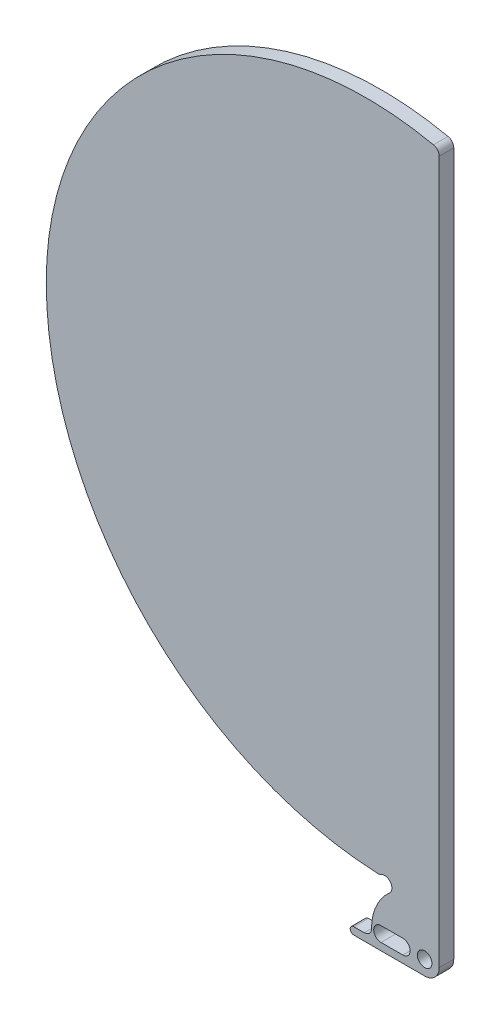
ISO-10303-21;
HEADER;
FILE_DESCRIPTION(('STEP AP214'),'2;1');
FILE_NAME('part.step','',(''),(''),'','','');
FILE_SCHEMA(('AUTOMOTIVE_DESIGN { 1 0 10303 214 1 1 1 1 }'));
ENDSEC;
DATA;
#1=APPLICATION_CONTEXT('core data for automotive mechanical design processes');
#2=APPLICATION_PROTOCOL_DEFINITION('international standard','automotive_design',2000,#1);
#3=PRODUCT_CONTEXT('',#1,'mechanical');
#4=PRODUCT('Part','Part','',(#3));
#5=PRODUCT_RELATED_PRODUCT_CATEGORY('part','',(#4));
#6=PRODUCT_DEFINITION_FORMATION('','',#4);
#7=PRODUCT_DEFINITION_CONTEXT('part definition',#1,'design');
#8=PRODUCT_DEFINITION('design','',#6,#7);
#9=PRODUCT_DEFINITION_SHAPE('','',#8);
#10=(LENGTH_UNIT() NAMED_UNIT(*) SI_UNIT(.MILLI.,.METRE.));
#11=(NAMED_UNIT(*) PLANE_ANGLE_UNIT() SI_UNIT($,.RADIAN.));
#12=(NAMED_UNIT(*) SI_UNIT($,.STERADIAN.) SOLID_ANGLE_UNIT());
#13=UNCERTAINTY_MEASURE_WITH_UNIT(LENGTH_MEASURE(1.E-05),#10,'distance_accuracy_value','');
#14=(GEOMETRIC_REPRESENTATION_CONTEXT(3) GLOBAL_UNCERTAINTY_ASSIGNED_CONTEXT((#13)) GLOBAL_UNIT_ASSIGNED_CONTEXT((#10,
#11,#12)) REPRESENTATION_CONTEXT('',''));
#15=CARTESIAN_POINT('',(0.,0.,0.));
#16=DIRECTION('',(0.,0.,1.));
#17=DIRECTION('',(1.,0.,0.));
#18=AXIS2_PLACEMENT_3D('',#15,#16,#17);
#19=CARTESIAN_POINT('',(-5.,25.75,0.5));
#20=DIRECTION('',(0.,0.,-1.));
#21=DIRECTION('',(-1.,0.,0.));
#22=AXIS2_PLACEMENT_3D('',#19,#20,#21);
#23=PLANE('',#22);
#24=CARTESIAN_POINT('',(-1.,-1.5,0.5));
#25=DIRECTION('',(0.,0.,1.));
#26=DIRECTION('',(1.,0.,0.));
#27=AXIS2_PLACEMENT_3D('',#24,#25,#26);
#28=CIRCLE('',#27,0.499999999999999);
#29=CARTESIAN_POINT('',(-0.500000000000001,-1.5,0.5));
#30=VERTEX_POINT('',#29);
#31=EDGE_CURVE('E199',#30,#30,#28,.T.);
#32=ORIENTED_EDGE('',*,*,#31,.F.);
#33=EDGE_LOOP('',(#32));
#34=FACE_BOUND('',#33,.T.);
#35=DIRECTION('',(-1.,0.,0.));
#36=VECTOR('',#35,1.);
#37=CARTESIAN_POINT('',(-4.61559123795819,-2.,0.5));
#38=LINE('',#37,#36);
#39=CARTESIAN_POINT('',(-5.15,-2.,0.5));
#40=VERTEX_POINT('',#39);
#41=CARTESIAN_POINT('',(-5.86559123795818,-2.,0.5));
#42=VERTEX_POINT('',#41);
#43=EDGE_CURVE('E216',#40,#42,#38,.T.);
#44=ORIENTED_EDGE('',*,*,#43,.T.);
#45=CARTESIAN_POINT('',(-5.86559123795818,-2.25,0.5));
#46=DIRECTION('',(0.,0.,-1.));
#47=DIRECTION('',(-1.,0.,0.));
#48=AXIS2_PLACEMENT_3D('',#45,#46,#47);
#49=CIRCLE('',#48,0.25);
#50=CARTESIAN_POINT('',(-6.11559123795818,-2.25,0.5));
#51=VERTEX_POINT('',#50);
#52=EDGE_CURVE('E273',#42,#51,#49,.F.);
#53=ORIENTED_EDGE('',*,*,#52,.T.);
#54=CARTESIAN_POINT('',(-5.86559123795819,-2.25,0.5));
#55=DIRECTION('',(0.,0.,-1.));
#56=DIRECTION('',(-1.,0.,0.));
#57=AXIS2_PLACEMENT_3D('',#54,#55,#56);
#58=CIRCLE('',#57,0.25);
#59=CARTESIAN_POINT('',(-5.86559123795819,-2.5,0.5));
#60=VERTEX_POINT('',#59);
#61=EDGE_CURVE('E60',#51,#60,#58,.F.);
#62=ORIENTED_EDGE('',*,*,#61,.T.);
#63=DIRECTION('',(1.,0.,0.));
#64=VECTOR('',#63,1.);
#65=CARTESIAN_POINT('',(-6.11559123795819,-2.5,0.5));
#66=LINE('',#65,#64);
#67=CARTESIAN_POINT('',(-1.,-2.5,0.5));
#68=VERTEX_POINT('',#67);
#69=EDGE_CURVE('E219',#60,#68,#66,.T.);
#70=ORIENTED_EDGE('',*,*,#69,.T.);
#71=CARTESIAN_POINT('',(-1.,-1.5,0.5));
#72=DIRECTION('',(0.,0.,1.));
#73=DIRECTION('',(1.,0.,0.));
#74=AXIS2_PLACEMENT_3D('',#71,#72,#73);
#75=CIRCLE('',#74,1.);
#76=CARTESIAN_POINT('',(0.,-1.5,0.5));
#77=VERTEX_POINT('',#76);
#78=EDGE_CURVE('E221',#68,#77,#75,.T.);
#79=ORIENTED_EDGE('',*,*,#78,.T.);
#80=DIRECTION('',(0.,1.,0.));
#81=VECTOR('',#80,1.);
#82=CARTESIAN_POINT('',(0.,-1.5,0.5));
#83=LINE('',#82,#81);
#84=CARTESIAN_POINT('',(0.,46.7737925723295,0.5));
#85=VERTEX_POINT('',#84);
#86=EDGE_CURVE('E223',#77,#85,#83,.T.);
#87=ORIENTED_EDGE('',*,*,#86,.T.);
#88=CARTESIAN_POINT('',(-0.5,46.7737925723295,0.5));
#89=DIRECTION('',(0.,0.,-1.));
#90=DIRECTION('',(-1.,0.,0.));
#91=AXIS2_PLACEMENT_3D('',#88,#89,#90);
#92=CIRCLE('',#91,0.5);
#93=CARTESIAN_POINT('',(-0.395348820696528,47.2627180581353,0.5));
#94=VERTEX_POINT('',#93);
#95=EDGE_CURVE('E270',#85,#94,#92,.F.);
#96=ORIENTED_EDGE('',*,*,#95,.T.);
#97=CARTESIAN_POINT('',(-5.,25.75,0.5));
#98=DIRECTION('',(0.,0.,1.));
#99=DIRECTION('',(-1.,0.,0.));
#100=AXIS2_PLACEMENT_3D('',#97,#98,#99);
#101=CIRCLE('',#100,21.9999966075425);
#102=CARTESIAN_POINT('',(-26.9999966075425,25.75,0.5));
#103=VERTEX_POINT('',#102);
#104=EDGE_CURVE('E205',#94,#103,#101,.T.);
#105=ORIENTED_EDGE('',*,*,#104,.T.);
#106=CARTESIAN_POINT('',(-3.15014615702515,25.8142703807271,0.5));
#107=DIRECTION('',(0.,0.,1.));
#108=DIRECTION('',(-1.,0.,0.));
#109=AXIS2_PLACEMENT_3D('',#106,#107,#108);
#110=CIRCLE('',#109,23.8499370480067);
#111=CARTESIAN_POINT('',(-4.24618895728837,1.98953140264235,0.5));
#112=VERTEX_POINT('',#111);
#113=EDGE_CURVE('E207',#103,#112,#110,.T.);
#114=ORIENTED_EDGE('',*,*,#113,.T.);
#115=CARTESIAN_POINT('',(-4.22321106015479,2.48900313982406,0.5));
#116=DIRECTION('',(0.,0.,-1.));
#117=DIRECTION('',(-1.,0.,0.));
#118=AXIS2_PLACEMENT_3D('',#115,#116,#117);
#119=CIRCLE('',#118,0.5);
#120=CARTESIAN_POINT('',(-3.98660553007739,2.04852859670404,0.5));
#121=VERTEX_POINT('',#120);
#122=EDGE_CURVE('E268',#112,#121,#119,.F.);
#123=ORIENTED_EDGE('',*,*,#122,.T.);
#124=CARTESIAN_POINT('',(-3.75,1.60805405358401,0.5));
#125=DIRECTION('',(0.,0.,-1.));
#126=DIRECTION('',(1.,0.,0.));
#127=AXIS2_PLACEMENT_3D('',#124,#125,#126);
#128=CIRCLE('',#127,0.499999999999999);
#129=CARTESIAN_POINT('',(-3.41867469879518,1.23358970977871,0.5));
#130=VERTEX_POINT('',#129);
#131=EDGE_CURVE('E211',#121,#130,#128,.T.);
#132=ORIENTED_EDGE('',*,*,#131,.T.);
#133=CARTESIAN_POINT('',(-1.,-1.5,0.5));
#134=DIRECTION('',(0.,0.,1.));
#135=DIRECTION('',(1.,0.,0.));
#136=AXIS2_PLACEMENT_3D('',#133,#134,#135);
#137=CIRCLE('',#136,3.65);
#138=CARTESIAN_POINT('',(-4.65,-1.5,0.5));
#139=VERTEX_POINT('',#138);
#140=EDGE_CURVE('E213',#130,#139,#137,.T.);
#141=ORIENTED_EDGE('',*,*,#140,.T.);
#142=CARTESIAN_POINT('',(-5.15,-1.5,0.5));
#143=DIRECTION('',(0.,0.,-1.));
#144=DIRECTION('',(-1.,0.,0.));
#145=AXIS2_PLACEMENT_3D('',#142,#143,#144);
#146=CIRCLE('',#145,0.5);
#147=EDGE_CURVE('E12',#139,#40,#146,.T.);
#148=ORIENTED_EDGE('',*,*,#147,.T.);
#149=EDGE_LOOP('',(#44,#53,#62,#70,#79,#87,#96,#105,#114,#123,#132,#141,#148));
#150=FACE_BOUND('',#149,.T.);
#151=CARTESIAN_POINT('',(-4.,-1.5,0.5));
#152=DIRECTION('',(0.,0.,1.));
#153=DIRECTION('',(1.,0.,0.));
#154=AXIS2_PLACEMENT_3D('',#151,#152,#153);
#155=CIRCLE('',#154,0.499999999999999);
#156=CARTESIAN_POINT('',(-4.,-1.,0.5));
#157=VERTEX_POINT('',#156);
#158=CARTESIAN_POINT('',(-4.,-2.,0.5));
#159=VERTEX_POINT('',#158);
#160=EDGE_CURVE('E158',#157,#159,#155,.T.);
#161=ORIENTED_EDGE('',*,*,#160,.F.);
#162=DIRECTION('',(-1.,0.,0.));
#163=VECTOR('',#162,1.);
#164=CARTESIAN_POINT('',(-4.,-1.,0.5));
#165=LINE('',#164,#163);
#166=CARTESIAN_POINT('',(-2.5,-0.999999999999999,0.5));
#167=VERTEX_POINT('',#166);
#168=EDGE_CURVE('E183',#167,#157,#165,.T.);
#169=ORIENTED_EDGE('',*,*,#168,.F.);
#170=CARTESIAN_POINT('',(-2.5,-1.5,0.5));
#171=DIRECTION('',(0.,0.,1.));
#172=DIRECTION('',(1.,0.,0.));
#173=AXIS2_PLACEMENT_3D('',#170,#171,#172);
#174=CIRCLE('',#173,0.5);
#175=CARTESIAN_POINT('',(-2.5,-2.,0.5));
#176=VERTEX_POINT('',#175);
#177=EDGE_CURVE('E181',#176,#167,#174,.T.);
#178=ORIENTED_EDGE('',*,*,#177,.F.);
#179=DIRECTION('',(1.,0.,0.));
#180=VECTOR('',#179,1.);
#181=CARTESIAN_POINT('',(-4.,-2.,0.5));
#182=LINE('',#181,#180);
#183=EDGE_CURVE('E168',#159,#176,#182,.T.);
#184=ORIENTED_EDGE('',*,*,#183,.F.);
#185=EDGE_LOOP('',(#161,#169,#178,#184));
#186=FACE_BOUND('',#185,.T.);
#187=ADVANCED_FACE('F36',(#34,#150,#186),#23,.F.);
#188=CARTESIAN_POINT('',(-5.,25.75,-0.5));
#189=DIRECTION('',(0.,0.,-1.));
#190=DIRECTION('',(-1.,0.,0.));
#191=AXIS2_PLACEMENT_3D('',#188,#189,#190);
#192=PLANE('',#191);
#193=CARTESIAN_POINT('',(-1.,-1.5,-0.5));
#194=DIRECTION('',(0.,0.,1.));
#195=DIRECTION('',(1.,0.,0.));
#196=AXIS2_PLACEMENT_3D('',#193,#194,#195);
#197=CIRCLE('',#196,0.499999999999999);
#198=CARTESIAN_POINT('',(-0.500000000000001,-1.5,-0.5));
#199=VERTEX_POINT('',#198);
#200=EDGE_CURVE('E176',#199,#199,#197,.T.);
#201=ORIENTED_EDGE('',*,*,#200,.T.);
#202=EDGE_LOOP('',(#201));
#203=FACE_BOUND('',#202,.T.);
#204=CARTESIAN_POINT('',(-5.86559123795819,-2.25,-0.5));
#205=DIRECTION('',(0.,0.,-1.));
#206=DIRECTION('',(-1.,0.,0.));
#207=AXIS2_PLACEMENT_3D('',#204,#205,#206);
#208=CIRCLE('',#207,0.25);
#209=CARTESIAN_POINT('',(-5.86559123795819,-2.5,-0.5));
#210=VERTEX_POINT('',#209);
#211=CARTESIAN_POINT('',(-6.11559123795818,-2.25,-0.5));
#212=VERTEX_POINT('',#211);
#213=EDGE_CURVE('E258',#210,#212,#208,.T.);
#214=ORIENTED_EDGE('',*,*,#213,.T.);
#215=CARTESIAN_POINT('',(-5.86559123795818,-2.25,-0.5));
#216=DIRECTION('',(0.,0.,-1.));
#217=DIRECTION('',(-1.,0.,0.));
#218=AXIS2_PLACEMENT_3D('',#215,#216,#217);
#219=CIRCLE('',#218,0.25);
#220=CARTESIAN_POINT('',(-5.86559123795818,-2.,-0.5));
#221=VERTEX_POINT('',#220);
#222=EDGE_CURVE('E260',#212,#221,#219,.T.);
#223=ORIENTED_EDGE('',*,*,#222,.T.);
#224=DIRECTION('',(-1.,0.,0.));
#225=VECTOR('',#224,1.);
#226=CARTESIAN_POINT('',(-4.61559123795819,-2.,-0.5));
#227=LINE('',#226,#225);
#228=CARTESIAN_POINT('',(-5.15,-2.,-0.5));
#229=VERTEX_POINT('',#228);
#230=EDGE_CURVE('E235',#229,#221,#227,.T.);
#231=ORIENTED_EDGE('',*,*,#230,.F.);
#232=CARTESIAN_POINT('',(-5.15,-1.5,-0.5));
#233=DIRECTION('',(0.,0.,-1.));
#234=DIRECTION('',(-1.,0.,0.));
#235=AXIS2_PLACEMENT_3D('',#232,#233,#234);
#236=CIRCLE('',#235,0.5);
#237=CARTESIAN_POINT('',(-4.65,-1.5,-0.5));
#238=VERTEX_POINT('',#237);
#239=EDGE_CURVE('E45',#229,#238,#236,.F.);
#240=ORIENTED_EDGE('',*,*,#239,.T.);
#241=CARTESIAN_POINT('',(-1.,-1.5,-0.5));
#242=DIRECTION('',(0.,0.,1.));
#243=DIRECTION('',(1.,0.,0.));
#244=AXIS2_PLACEMENT_3D('',#241,#242,#243);
#245=CIRCLE('',#244,3.65);
#246=CARTESIAN_POINT('',(-3.41867469879518,1.23358970977871,-0.5));
#247=VERTEX_POINT('',#246);
#248=EDGE_CURVE('E232',#247,#238,#245,.T.);
#249=ORIENTED_EDGE('',*,*,#248,.F.);
#250=CARTESIAN_POINT('',(-3.75,1.60805405358401,-0.5));
#251=DIRECTION('',(0.,0.,-1.));
#252=DIRECTION('',(1.,0.,0.));
#253=AXIS2_PLACEMENT_3D('',#250,#251,#252);
#254=CIRCLE('',#253,0.499999999999999);
#255=CARTESIAN_POINT('',(-3.98660553007739,2.04852859670404,-0.5));
#256=VERTEX_POINT('',#255);
#257=EDGE_CURVE('E230',#256,#247,#254,.T.);
#258=ORIENTED_EDGE('',*,*,#257,.F.);
#259=CARTESIAN_POINT('',(-4.22321106015479,2.48900313982406,-0.5));
#260=DIRECTION('',(0.,0.,-1.));
#261=DIRECTION('',(-1.,0.,0.));
#262=AXIS2_PLACEMENT_3D('',#259,#260,#261);
#263=CIRCLE('',#262,0.5);
#264=CARTESIAN_POINT('',(-4.24618895728837,1.98953140264235,-0.5));
#265=VERTEX_POINT('',#264);
#266=EDGE_CURVE('E254',#256,#265,#263,.T.);
#267=ORIENTED_EDGE('',*,*,#266,.T.);
#268=CARTESIAN_POINT('',(-3.15014615702515,25.8142703807271,-0.5));
#269=DIRECTION('',(0.,0.,1.));
#270=DIRECTION('',(-1.,0.,0.));
#271=AXIS2_PLACEMENT_3D('',#268,#269,#270);
#272=CIRCLE('',#271,23.8499370480067);
#273=CARTESIAN_POINT('',(-26.9999966075425,25.75,-0.5));
#274=VERTEX_POINT('',#273);
#275=EDGE_CURVE('E227',#274,#265,#272,.T.);
#276=ORIENTED_EDGE('',*,*,#275,.F.);
#277=CARTESIAN_POINT('',(-5.,25.75,-0.5));
#278=DIRECTION('',(0.,0.,1.));
#279=DIRECTION('',(-1.,0.,0.));
#280=AXIS2_PLACEMENT_3D('',#277,#278,#279);
#281=CIRCLE('',#280,21.9999966075425);
#282=CARTESIAN_POINT('',(-0.395348820696528,47.2627180581353,-0.5));
#283=VERTEX_POINT('',#282);
#284=EDGE_CURVE('E202',#283,#274,#281,.T.);
#285=ORIENTED_EDGE('',*,*,#284,.F.);
#286=CARTESIAN_POINT('',(-0.5,46.7737925723295,-0.5));
#287=DIRECTION('',(0.,0.,-1.));
#288=DIRECTION('',(-1.,0.,0.));
#289=AXIS2_PLACEMENT_3D('',#286,#287,#288);
#290=CIRCLE('',#289,0.5);
#291=CARTESIAN_POINT('',(0.,46.7737925723295,-0.5));
#292=VERTEX_POINT('',#291);
#293=EDGE_CURVE('E256',#283,#292,#290,.T.);
#294=ORIENTED_EDGE('',*,*,#293,.T.);
#295=DIRECTION('',(0.,1.,0.));
#296=VECTOR('',#295,1.);
#297=CARTESIAN_POINT('',(0.,-1.5,-0.5));
#298=LINE('',#297,#296);
#299=CARTESIAN_POINT('',(0.,-1.5,-0.5));
#300=VERTEX_POINT('',#299);
#301=EDGE_CURVE('E208',#300,#292,#298,.T.);
#302=ORIENTED_EDGE('',*,*,#301,.F.);
#303=CARTESIAN_POINT('',(-1.,-1.5,-0.5));
#304=DIRECTION('',(0.,0.,1.));
#305=DIRECTION('',(1.,0.,0.));
#306=AXIS2_PLACEMENT_3D('',#303,#304,#305);
#307=CIRCLE('',#306,1.);
#308=CARTESIAN_POINT('',(-1.,-2.5,-0.5));
#309=VERTEX_POINT('',#308);
#310=EDGE_CURVE('E240',#309,#300,#307,.T.);
#311=ORIENTED_EDGE('',*,*,#310,.F.);
#312=DIRECTION('',(1.,0.,0.));
#313=VECTOR('',#312,1.);
#314=CARTESIAN_POINT('',(-6.11559123795819,-2.5,-0.5));
#315=LINE('',#314,#313);
#316=EDGE_CURVE('E238',#210,#309,#315,.T.);
#317=ORIENTED_EDGE('',*,*,#316,.F.);
#318=EDGE_LOOP('',(#214,#223,#231,#240,#249,#258,#267,#276,#285,#294,#302,#311,#317));
#319=FACE_BOUND('',#318,.T.);
#320=DIRECTION('',(-1.,0.,0.));
#321=VECTOR('',#320,1.);
#322=CARTESIAN_POINT('',(-4.,-1.,-0.5));
#323=LINE('',#322,#321);
#324=CARTESIAN_POINT('',(-2.5,-0.999999999999999,-0.5));
#325=VERTEX_POINT('',#324);
#326=CARTESIAN_POINT('',(-4.,-1.,-0.5));
#327=VERTEX_POINT('',#326);
#328=EDGE_CURVE('E169',#325,#327,#323,.T.);
#329=ORIENTED_EDGE('',*,*,#328,.T.);
#330=CARTESIAN_POINT('',(-4.,-1.5,-0.5));
#331=DIRECTION('',(0.,0.,1.));
#332=DIRECTION('',(1.,0.,0.));
#333=AXIS2_PLACEMENT_3D('',#330,#331,#332);
#334=CIRCLE('',#333,0.499999999999999);
#335=CARTESIAN_POINT('',(-4.,-2.,-0.5));
#336=VERTEX_POINT('',#335);
#337=EDGE_CURVE('E187',#327,#336,#334,.T.);
#338=ORIENTED_EDGE('',*,*,#337,.T.);
#339=DIRECTION('',(1.,0.,0.));
#340=VECTOR('',#339,1.);
#341=CARTESIAN_POINT('',(-4.,-2.,-0.5));
#342=LINE('',#341,#340);
#343=CARTESIAN_POINT('',(-2.5,-2.,-0.5));
#344=VERTEX_POINT('',#343);
#345=EDGE_CURVE('E175',#336,#344,#342,.T.);
#346=ORIENTED_EDGE('',*,*,#345,.T.);
#347=CARTESIAN_POINT('',(-2.5,-1.5,-0.5));
#348=DIRECTION('',(0.,0.,1.));
#349=DIRECTION('',(1.,0.,0.));
#350=AXIS2_PLACEMENT_3D('',#347,#348,#349);
#351=CIRCLE('',#350,0.5);
#352=EDGE_CURVE('E190',#344,#325,#351,.T.);
#353=ORIENTED_EDGE('',*,*,#352,.T.);
#354=EDGE_LOOP('',(#329,#338,#346,#353));
#355=FACE_BOUND('',#354,.T.);
#356=ADVANCED_FACE('F291',(#203,#319,#355),#192,.T.);
#357=CARTESIAN_POINT('',(-5.,25.75,0.5));
#358=DIRECTION('',(0.,0.,-1.));
#359=DIRECTION('',(-1.,0.,0.));
#360=AXIS2_PLACEMENT_3D('',#357,#358,#359);
#361=CYLINDRICAL_SURFACE('',#360,21.9999966075425);
#362=ORIENTED_EDGE('',*,*,#104,.F.);
#363=DIRECTION('',(0.,0.,-1.));
#364=VECTOR('',#363,1.);
#365=CARTESIAN_POINT('',(-0.395348820696527,47.2627180581353,0.5));
#366=LINE('',#365,#364);
#367=EDGE_CURVE('E277',#94,#283,#366,.T.);
#368=ORIENTED_EDGE('',*,*,#367,.T.);
#369=ORIENTED_EDGE('',*,*,#284,.T.);
#370=DIRECTION('',(0.,0.,-1.));
#371=VECTOR('',#370,1.);
#372=CARTESIAN_POINT('',(-26.9999966075425,25.75,0.5));
#373=LINE('',#372,#371);
#374=EDGE_CURVE('E251',#103,#274,#373,.T.);
#375=ORIENTED_EDGE('',*,*,#374,.F.);
#376=EDGE_LOOP('',(#362,#368,#369,#375));
#377=FACE_BOUND('',#376,.T.);
#378=ADVANCED_FACE('F334',(#377),#361,.T.);
#379=CARTESIAN_POINT('',(-3.15014615702515,25.8142703807271,0.5));
#380=DIRECTION('',(0.,0.,-1.));
#381=DIRECTION('',(-1.,0.,0.));
#382=AXIS2_PLACEMENT_3D('',#379,#380,#381);
#383=CYLINDRICAL_SURFACE('',#382,23.8499370480067);
#384=ORIENTED_EDGE('',*,*,#275,.T.);
#385=DIRECTION('',(0.,0.,-1.));
#386=VECTOR('',#385,1.);
#387=CARTESIAN_POINT('',(-4.24618895728837,1.98953140264235,0.5));
#388=LINE('',#387,#386);
#389=EDGE_CURVE('E286',#265,#112,#388,.F.);
#390=ORIENTED_EDGE('',*,*,#389,.T.);
#391=ORIENTED_EDGE('',*,*,#113,.F.);
#392=ORIENTED_EDGE('',*,*,#374,.T.);
#393=EDGE_LOOP('',(#384,#390,#391,#392));
#394=FACE_BOUND('',#393,.T.);
#395=ADVANCED_FACE('F340',(#394),#383,.T.);
#396=CARTESIAN_POINT('',(-3.75,1.60805405358401,0.5));
#397=DIRECTION('',(0.,0.,-1.));
#398=DIRECTION('',(-1.,0.,0.));
#399=AXIS2_PLACEMENT_3D('',#396,#397,#398);
#400=CYLINDRICAL_SURFACE('',#399,0.499999999999999);
#401=ORIENTED_EDGE('',*,*,#131,.F.);
#402=DIRECTION('',(0.,0.,-1.));
#403=VECTOR('',#402,1.);
#404=CARTESIAN_POINT('',(-3.98660553007739,2.04852859670404,0.5));
#405=LINE('',#404,#403);
#406=EDGE_CURVE('E283',#121,#256,#405,.T.);
#407=ORIENTED_EDGE('',*,*,#406,.T.);
#408=ORIENTED_EDGE('',*,*,#257,.T.);
#409=DIRECTION('',(0.,0.,-1.));
#410=VECTOR('',#409,1.);
#411=CARTESIAN_POINT('',(-3.41867469879518,1.23358970977871,0.5));
#412=LINE('',#411,#410);
#413=EDGE_CURVE('E248',#130,#247,#412,.T.);
#414=ORIENTED_EDGE('',*,*,#413,.F.);
#415=EDGE_LOOP('',(#401,#407,#408,#414));
#416=FACE_BOUND('',#415,.T.);
#417=ADVANCED_FACE('F346',(#416),#400,.F.);
#418=CARTESIAN_POINT('',(-1.,-1.5,0.5));
#419=DIRECTION('',(0.,0.,-1.));
#420=DIRECTION('',(-1.,0.,0.));
#421=AXIS2_PLACEMENT_3D('',#418,#419,#420);
#422=CYLINDRICAL_SURFACE('',#421,3.65);
#423=ORIENTED_EDGE('',*,*,#248,.T.);
#424=DIRECTION('',(0.,0.,-1.));
#425=VECTOR('',#424,1.);
#426=CARTESIAN_POINT('',(-4.65,-1.5,0.5));
#427=LINE('',#426,#425);
#428=EDGE_CURVE('E281',#238,#139,#427,.F.);
#429=ORIENTED_EDGE('',*,*,#428,.T.);
#430=ORIENTED_EDGE('',*,*,#140,.F.);
#431=ORIENTED_EDGE('',*,*,#413,.T.);
#432=EDGE_LOOP('',(#423,#429,#430,#431));
#433=FACE_BOUND('',#432,.T.);
#434=ADVANCED_FACE('F298',(#433),#422,.T.);
#435=CARTESIAN_POINT('',(-4.61559123795819,-2.,0.5));
#436=DIRECTION('',(0.,-1.,0.));
#437=DIRECTION('',(1.,0.,0.));
#438=AXIS2_PLACEMENT_3D('',#435,#436,#437);
#439=PLANE('',#438);
#440=ORIENTED_EDGE('',*,*,#230,.T.);
#441=DIRECTION('',(0.,0.,-1.));
#442=VECTOR('',#441,1.);
#443=CARTESIAN_POINT('',(-5.86559123795818,-2.,0.5));
#444=LINE('',#443,#442);
#445=EDGE_CURVE('E265',#221,#42,#444,.F.);
#446=ORIENTED_EDGE('',*,*,#445,.T.);
#447=ORIENTED_EDGE('',*,*,#43,.F.);
#448=DIRECTION('',(0.,0.,1.));
#449=VECTOR('',#448,1.);
#450=CARTESIAN_POINT('',(-5.15,-2.,-0.5));
#451=LINE('',#450,#449);
#452=EDGE_CURVE('E262',#40,#229,#451,.F.);
#453=ORIENTED_EDGE('',*,*,#452,.T.);
#454=EDGE_LOOP('',(#440,#446,#447,#453));
#455=FACE_BOUND('',#454,.T.);
#456=ADVANCED_FACE('F305',(#455),#439,.F.);
#457=CARTESIAN_POINT('',(-6.11559123795819,-2.5,0.5));
#458=DIRECTION('',(0.,1.,0.));
#459=DIRECTION('',(0.,0.,1.));
#460=AXIS2_PLACEMENT_3D('',#457,#458,#459);
#461=PLANE('',#460);
#462=ORIENTED_EDGE('',*,*,#69,.F.);
#463=DIRECTION('',(0.,0.,-1.));
#464=VECTOR('',#463,1.);
#465=CARTESIAN_POINT('',(-5.86559123795819,-2.5,0.5));
#466=LINE('',#465,#464);
#467=EDGE_CURVE('E275',#60,#210,#466,.T.);
#468=ORIENTED_EDGE('',*,*,#467,.T.);
#469=ORIENTED_EDGE('',*,*,#316,.T.);
#470=DIRECTION('',(0.,0.,-1.));
#471=VECTOR('',#470,1.);
#472=CARTESIAN_POINT('',(-1.,-2.5,0.5));
#473=LINE('',#472,#471);
#474=EDGE_CURVE('E245',#68,#309,#473,.T.);
#475=ORIENTED_EDGE('',*,*,#474,.F.);
#476=EDGE_LOOP('',(#462,#468,#469,#475));
#477=FACE_BOUND('',#476,.T.);
#478=ADVANCED_FACE('F318',(#477),#461,.F.);
#479=CARTESIAN_POINT('',(-1.,-1.5,0.5));
#480=DIRECTION('',(0.,0.,-1.));
#481=DIRECTION('',(-1.,0.,0.));
#482=AXIS2_PLACEMENT_3D('',#479,#480,#481);
#483=CYLINDRICAL_SURFACE('',#482,1.);
#484=ORIENTED_EDGE('',*,*,#310,.T.);
#485=DIRECTION('',(0.,0.,-1.));
#486=VECTOR('',#485,1.);
#487=CARTESIAN_POINT('',(0.,-1.5,0.5));
#488=LINE('',#487,#486);
#489=EDGE_CURVE('E225',#77,#300,#488,.T.);
#490=ORIENTED_EDGE('',*,*,#489,.F.);
#491=ORIENTED_EDGE('',*,*,#78,.F.);
#492=ORIENTED_EDGE('',*,*,#474,.T.);
#493=EDGE_LOOP('',(#484,#490,#491,#492));
#494=FACE_BOUND('',#493,.T.);
#495=ADVANCED_FACE('F324',(#494),#483,.T.);
#496=CARTESIAN_POINT('',(0.,-1.5,0.5));
#497=DIRECTION('',(-1.,0.,0.));
#498=DIRECTION('',(0.,-1.,0.));
#499=AXIS2_PLACEMENT_3D('',#496,#497,#498);
#500=PLANE('',#499);
#501=ORIENTED_EDGE('',*,*,#301,.T.);
#502=DIRECTION('',(0.,0.,-1.));
#503=VECTOR('',#502,1.);
#504=CARTESIAN_POINT('',(0.,46.7737925723295,0.5));
#505=LINE('',#504,#503);
#506=EDGE_CURVE('E52',#292,#85,#505,.F.);
#507=ORIENTED_EDGE('',*,*,#506,.T.);
#508=ORIENTED_EDGE('',*,*,#86,.F.);
#509=ORIENTED_EDGE('',*,*,#489,.T.);
#510=EDGE_LOOP('',(#501,#507,#508,#509));
#511=FACE_BOUND('',#510,.T.);
#512=ADVANCED_FACE('F326',(#511),#500,.F.);
#513=CARTESIAN_POINT('',(-1.,-1.5,0.5));
#514=DIRECTION('',(0.,0.,-1.));
#515=DIRECTION('',(-1.,0.,0.));
#516=AXIS2_PLACEMENT_3D('',#513,#514,#515);
#517=CYLINDRICAL_SURFACE('',#516,0.499999999999999);
#518=ORIENTED_EDGE('',*,*,#31,.T.);
#519=EDGE_LOOP('',(#518));
#520=FACE_BOUND('',#519,.T.);
#521=ORIENTED_EDGE('',*,*,#200,.F.);
#522=EDGE_LOOP('',(#521));
#523=FACE_BOUND('',#522,.T.);
#524=ADVANCED_FACE('F365',(#520,#523),#517,.F.);
#525=CARTESIAN_POINT('',(-4.,-1.5,0.5));
#526=DIRECTION('',(0.,0.,-1.));
#527=DIRECTION('',(-1.,0.,0.));
#528=AXIS2_PLACEMENT_3D('',#525,#526,#527);
#529=CYLINDRICAL_SURFACE('',#528,0.499999999999999);
#530=ORIENTED_EDGE('',*,*,#337,.F.);
#531=DIRECTION('',(0.,0.,-1.));
#532=VECTOR('',#531,1.);
#533=CARTESIAN_POINT('',(-4.,-1.,0.5));
#534=LINE('',#533,#532);
#535=EDGE_CURVE('E164',#157,#327,#534,.T.);
#536=ORIENTED_EDGE('',*,*,#535,.F.);
#537=ORIENTED_EDGE('',*,*,#160,.T.);
#538=DIRECTION('',(0.,0.,-1.));
#539=VECTOR('',#538,1.);
#540=CARTESIAN_POINT('',(-4.,-2.,0.5));
#541=LINE('',#540,#539);
#542=EDGE_CURVE('E161',#159,#336,#541,.T.);
#543=ORIENTED_EDGE('',*,*,#542,.T.);
#544=EDGE_LOOP('',(#530,#536,#537,#543));
#545=FACE_BOUND('',#544,.T.);
#546=ADVANCED_FACE('F160',(#545),#529,.F.);
#547=CARTESIAN_POINT('',(-4.,-2.,0.5));
#548=DIRECTION('',(0.,1.,0.));
#549=DIRECTION('',(-1.,0.,0.));
#550=AXIS2_PLACEMENT_3D('',#547,#548,#549);
#551=PLANE('',#550);
#552=ORIENTED_EDGE('',*,*,#345,.F.);
#553=ORIENTED_EDGE('',*,*,#542,.F.);
#554=ORIENTED_EDGE('',*,*,#183,.T.);
#555=DIRECTION('',(0.,0.,-1.));
#556=VECTOR('',#555,1.);
#557=CARTESIAN_POINT('',(-2.5,-2.,0.5));
#558=LINE('',#557,#556);
#559=EDGE_CURVE('E177',#176,#344,#558,.T.);
#560=ORIENTED_EDGE('',*,*,#559,.T.);
#561=EDGE_LOOP('',(#552,#553,#554,#560));
#562=FACE_BOUND('',#561,.T.);
#563=ADVANCED_FACE('F172',(#562),#551,.T.);
#564=CARTESIAN_POINT('',(-2.5,-1.5,0.5));
#565=DIRECTION('',(0.,0.,-1.));
#566=DIRECTION('',(-1.,0.,0.));
#567=AXIS2_PLACEMENT_3D('',#564,#565,#566);
#568=CYLINDRICAL_SURFACE('',#567,0.5);
#569=ORIENTED_EDGE('',*,*,#352,.F.);
#570=ORIENTED_EDGE('',*,*,#559,.F.);
#571=ORIENTED_EDGE('',*,*,#177,.T.);
#572=DIRECTION('',(0.,0.,-1.));
#573=VECTOR('',#572,1.);
#574=CARTESIAN_POINT('',(-2.5,-0.999999999999999,0.5));
#575=LINE('',#574,#573);
#576=EDGE_CURVE('E196',#167,#325,#575,.T.);
#577=ORIENTED_EDGE('',*,*,#576,.T.);
#578=EDGE_LOOP('',(#569,#570,#571,#577));
#579=FACE_BOUND('',#578,.T.);
#580=ADVANCED_FACE('F409',(#579),#568,.F.);
#581=CARTESIAN_POINT('',(-4.,-1.,0.5));
#582=DIRECTION('',(0.,-1.,0.));
#583=DIRECTION('',(1.,0.,0.));
#584=AXIS2_PLACEMENT_3D('',#581,#582,#583);
#585=PLANE('',#584);
#586=ORIENTED_EDGE('',*,*,#328,.F.);
#587=ORIENTED_EDGE('',*,*,#576,.F.);
#588=ORIENTED_EDGE('',*,*,#168,.T.);
#589=ORIENTED_EDGE('',*,*,#535,.T.);
#590=EDGE_LOOP('',(#586,#587,#588,#589));
#591=FACE_BOUND('',#590,.T.);
#592=ADVANCED_FACE('F416',(#591),#585,.T.);
#593=CARTESIAN_POINT('',(-5.86559123795819,-2.25,0.5));
#594=DIRECTION('',(0.,0.,-1.));
#595=DIRECTION('',(-1.,0.,0.));
#596=AXIS2_PLACEMENT_3D('',#593,#594,#595);
#597=CYLINDRICAL_SURFACE('',#596,0.25);
#598=ORIENTED_EDGE('',*,*,#467,.F.);
#599=ORIENTED_EDGE('',*,*,#61,.F.);
#600=DIRECTION('',(0.,0.,-1.));
#601=VECTOR('',#600,1.);
#602=CARTESIAN_POINT('',(-6.11559123795818,-2.25,0.5));
#603=LINE('',#602,#601);
#604=EDGE_CURVE('E40',#212,#51,#603,.F.);
#605=ORIENTED_EDGE('',*,*,#604,.F.);
#606=ORIENTED_EDGE('',*,*,#213,.F.);
#607=EDGE_LOOP('',(#598,#599,#605,#606));
#608=FACE_BOUND('',#607,.T.);
#609=ADVANCED_FACE('F314',(#608),#597,.T.);
#610=CARTESIAN_POINT('',(-5.86559123795818,-2.25,0.5));
#611=DIRECTION('',(0.,0.,-1.));
#612=DIRECTION('',(-1.,0.,0.));
#613=AXIS2_PLACEMENT_3D('',#610,#611,#612);
#614=CYLINDRICAL_SURFACE('',#613,0.25);
#615=ORIENTED_EDGE('',*,*,#52,.F.);
#616=ORIENTED_EDGE('',*,*,#445,.F.);
#617=ORIENTED_EDGE('',*,*,#222,.F.);
#618=ORIENTED_EDGE('',*,*,#604,.T.);
#619=EDGE_LOOP('',(#615,#616,#617,#618));
#620=FACE_BOUND('',#619,.T.);
#621=ADVANCED_FACE('F309',(#620),#614,.T.);
#622=CARTESIAN_POINT('',(-0.5,46.7737925723295,0.5));
#623=DIRECTION('',(0.,0.,-1.));
#624=DIRECTION('',(-1.,0.,0.));
#625=AXIS2_PLACEMENT_3D('',#622,#623,#624);
#626=CYLINDRICAL_SURFACE('',#625,0.5);
#627=ORIENTED_EDGE('',*,*,#95,.F.);
#628=ORIENTED_EDGE('',*,*,#506,.F.);
#629=ORIENTED_EDGE('',*,*,#293,.F.);
#630=ORIENTED_EDGE('',*,*,#367,.F.);
#631=EDGE_LOOP('',(#627,#628,#629,#630));
#632=FACE_BOUND('',#631,.T.);
#633=ADVANCED_FACE('F331',(#632),#626,.T.);
#634=CARTESIAN_POINT('',(-5.15,-1.5,0.5));
#635=DIRECTION('',(0.,0.,-1.));
#636=DIRECTION('',(-1.,0.,0.));
#637=AXIS2_PLACEMENT_3D('',#634,#635,#636);
#638=CYLINDRICAL_SURFACE('',#637,0.5);
#639=ORIENTED_EDGE('',*,*,#147,.F.);
#640=ORIENTED_EDGE('',*,*,#428,.F.);
#641=ORIENTED_EDGE('',*,*,#239,.F.);
#642=ORIENTED_EDGE('',*,*,#452,.F.);
#643=EDGE_LOOP('',(#639,#640,#641,#642));
#644=FACE_BOUND('',#643,.T.);
#645=ADVANCED_FACE('F302',(#644),#638,.F.);
#646=CARTESIAN_POINT('',(-4.22321106015479,2.48900313982406,0.5));
#647=DIRECTION('',(0.,0.,1.));
#648=DIRECTION('',(1.,0.,0.));
#649=AXIS2_PLACEMENT_3D('',#646,#647,#648);
#650=CYLINDRICAL_SURFACE('',#649,0.5);
#651=ORIENTED_EDGE('',*,*,#122,.F.);
#652=ORIENTED_EDGE('',*,*,#389,.F.);
#653=ORIENTED_EDGE('',*,*,#266,.F.);
#654=ORIENTED_EDGE('',*,*,#406,.F.);
#655=EDGE_LOOP('',(#651,#652,#653,#654));
#656=FACE_BOUND('',#655,.T.);
#657=ADVANCED_FACE('F38',(#656),#650,.T.);
#658=CLOSED_SHELL('',(#187,#356,#378,#395,#417,#434,#456,#478,#495,#512,#524,#546,#563,#580,
#592,#609,#621,#633,#645,#657));
#659=MANIFOLD_SOLID_BREP('B2',#658);
#660=ADVANCED_BREP_SHAPE_REPRESENTATION('',(#18,#659),#14);
#661=SHAPE_DEFINITION_REPRESENTATION(#9,#660);
ENDSEC;
END-ISO-10303-21;
